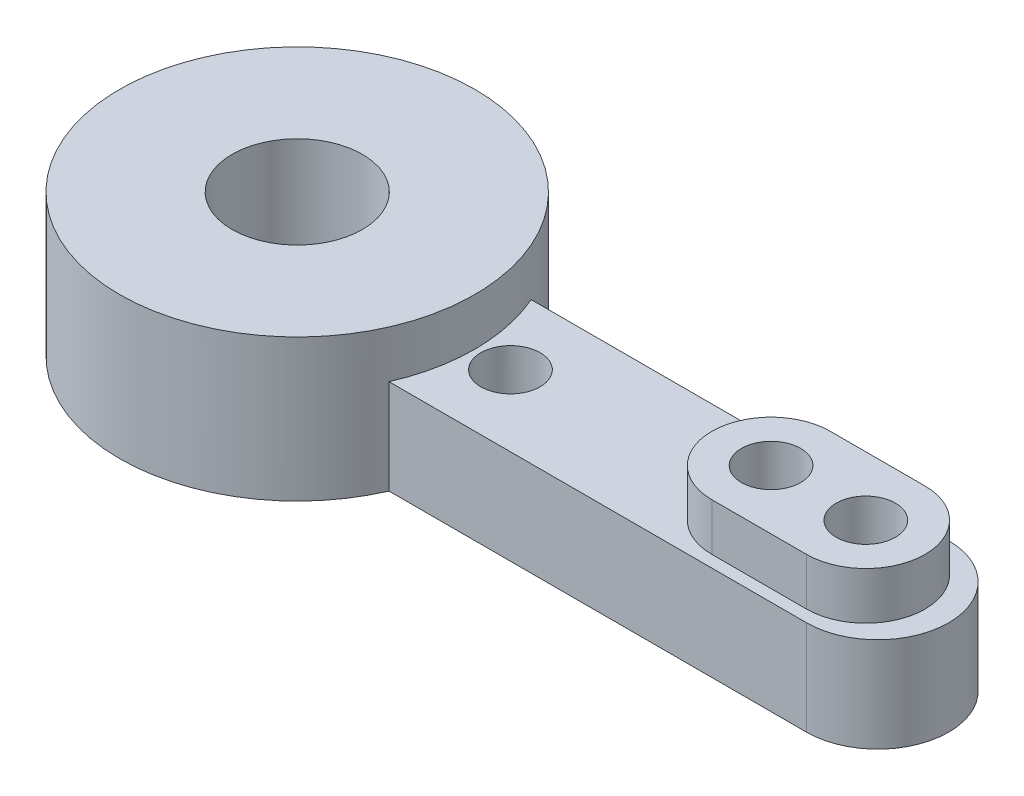
ISO-10303-21;
HEADER;
FILE_DESCRIPTION(('STEP AP214'),'2;1');
FILE_NAME('part.step','',(''),(''),'','','');
FILE_SCHEMA(('AUTOMOTIVE_DESIGN { 1 0 10303 214 1 1 1 1 }'));
ENDSEC;
DATA;
#1=APPLICATION_CONTEXT('core data for automotive mechanical design processes');
#2=APPLICATION_PROTOCOL_DEFINITION('international standard','automotive_design',2000,#1);
#3=PRODUCT_CONTEXT('',#1,'mechanical');
#4=PRODUCT('Part','Part','',(#3));
#5=PRODUCT_RELATED_PRODUCT_CATEGORY('part','',(#4));
#6=PRODUCT_DEFINITION_FORMATION('','',#4);
#7=PRODUCT_DEFINITION_CONTEXT('part definition',#1,'design');
#8=PRODUCT_DEFINITION('design','',#6,#7);
#9=PRODUCT_DEFINITION_SHAPE('','',#8);
#10=(LENGTH_UNIT() NAMED_UNIT(*) SI_UNIT(.MILLI.,.METRE.));
#11=(NAMED_UNIT(*) PLANE_ANGLE_UNIT() SI_UNIT($,.RADIAN.));
#12=(NAMED_UNIT(*) SI_UNIT($,.STERADIAN.) SOLID_ANGLE_UNIT());
#13=UNCERTAINTY_MEASURE_WITH_UNIT(LENGTH_MEASURE(1.E-05),#10,'distance_accuracy_value','');
#14=(GEOMETRIC_REPRESENTATION_CONTEXT(3) GLOBAL_UNCERTAINTY_ASSIGNED_CONTEXT((#13)) GLOBAL_UNIT_ASSIGNED_CONTEXT((#10,
#11,#12)) REPRESENTATION_CONTEXT('',''));
#15=CARTESIAN_POINT('',(0.,0.,0.));
#16=DIRECTION('',(0.,0.,1.));
#17=DIRECTION('',(1.,0.,0.));
#18=AXIS2_PLACEMENT_3D('',#15,#16,#17);
#19=CARTESIAN_POINT('',(0.,0.,0.));
#20=DIRECTION('',(0.,-1.,0.));
#21=DIRECTION('',(0.,0.,-1.));
#22=AXIS2_PLACEMENT_3D('',#19,#20,#21);
#23=CYLINDRICAL_SURFACE('',#22,1.25);
#24=CARTESIAN_POINT('',(0.,2.,0.));
#25=DIRECTION('',(0.,1.,0.));
#26=DIRECTION('',(0.,0.,1.));
#27=AXIS2_PLACEMENT_3D('',#24,#25,#26);
#28=CIRCLE('',#27,1.25);
#29=CARTESIAN_POINT('',(0.,2.,1.25));
#30=VERTEX_POINT('',#29);
#31=EDGE_CURVE('E188',#30,#30,#28,.F.);
#32=ORIENTED_EDGE('',*,*,#31,.F.);
#33=EDGE_LOOP('',(#32));
#34=FACE_BOUND('',#33,.T.);
#35=CARTESIAN_POINT('',(0.,0.75,0.));
#36=DIRECTION('',(0.,-1.,0.));
#37=DIRECTION('',(0.,0.,-1.));
#38=AXIS2_PLACEMENT_3D('',#35,#36,#37);
#39=CIRCLE('',#38,1.25);
#40=CARTESIAN_POINT('',(0.,0.75,-1.25));
#41=VERTEX_POINT('',#40);
#42=EDGE_CURVE('E51',#41,#41,#39,.F.);
#43=ORIENTED_EDGE('',*,*,#42,.F.);
#44=EDGE_LOOP('',(#43));
#45=FACE_BOUND('',#44,.T.);
#46=ADVANCED_FACE('F47',(#34,#45),#23,.F.);
#47=CARTESIAN_POINT('',(0.,6.,0.));
#48=DIRECTION('',(0.,1.,0.));
#49=DIRECTION('',(0.,0.,1.));
#50=AXIS2_PLACEMENT_3D('',#47,#48,#49);
#51=PLANE('',#50);
#52=CARTESIAN_POINT('',(20.,6.,0.));
#53=DIRECTION('',(0.,-1.,0.));
#54=DIRECTION('',(0.,0.,-1.));
#55=AXIS2_PLACEMENT_3D('',#52,#53,#54);
#56=CIRCLE('',#55,1.25);
#57=CARTESIAN_POINT('',(20.,6.,-1.25));
#58=VERTEX_POINT('',#57);
#59=EDGE_CURVE('E197',#58,#58,#56,.T.);
#60=ORIENTED_EDGE('',*,*,#59,.T.);
#61=EDGE_LOOP('',(#60));
#62=FACE_BOUND('',#61,.T.);
#63=CARTESIAN_POINT('',(20.,6.,0.));
#64=DIRECTION('',(0.,1.,0.));
#65=DIRECTION('',(0.,0.,1.));
#66=AXIS2_PLACEMENT_3D('',#63,#64,#65);
#67=CIRCLE('',#66,2.5);
#68=CARTESIAN_POINT('',(20.,6.,-2.5));
#69=VERTEX_POINT('',#68);
#70=CARTESIAN_POINT('',(20.,6.,2.5));
#71=VERTEX_POINT('',#70);
#72=EDGE_CURVE('E134',#69,#71,#67,.T.);
#73=ORIENTED_EDGE('',*,*,#72,.T.);
#74=DIRECTION('',(1.,0.,0.));
#75=VECTOR('',#74,1.);
#76=CARTESIAN_POINT('',(0.,6.,2.5));
#77=LINE('',#76,#75);
#78=CARTESIAN_POINT('',(24.,6.,2.5));
#79=VERTEX_POINT('',#78);
#80=EDGE_CURVE('E140',#71,#79,#77,.T.);
#81=ORIENTED_EDGE('',*,*,#80,.T.);
#82=CARTESIAN_POINT('',(24.,6.,0.));
#83=DIRECTION('',(0.,1.,0.));
#84=DIRECTION('',(0.,0.,1.));
#85=AXIS2_PLACEMENT_3D('',#82,#83,#84);
#86=CIRCLE('',#85,2.5);
#87=CARTESIAN_POINT('',(24.,6.,-2.5));
#88=VERTEX_POINT('',#87);
#89=EDGE_CURVE('E145',#79,#88,#86,.T.);
#90=ORIENTED_EDGE('',*,*,#89,.T.);
#91=DIRECTION('',(1.,0.,0.));
#92=VECTOR('',#91,1.);
#93=CARTESIAN_POINT('',(0.,6.,-2.5));
#94=LINE('',#93,#92);
#95=EDGE_CURVE('E125',#69,#88,#94,.T.);
#96=ORIENTED_EDGE('',*,*,#95,.F.);
#97=EDGE_LOOP('',(#73,#81,#90,#96));
#98=FACE_BOUND('',#97,.T.);
#99=CARTESIAN_POINT('',(24.,6.,0.));
#100=DIRECTION('',(0.,-1.,0.));
#101=DIRECTION('',(0.,0.,-1.));
#102=AXIS2_PLACEMENT_3D('',#99,#100,#101);
#103=CIRCLE('',#102,1.25);
#104=CARTESIAN_POINT('',(24.,6.,-1.25));
#105=VERTEX_POINT('',#104);
#106=EDGE_CURVE('E209',#105,#105,#103,.T.);
#107=ORIENTED_EDGE('',*,*,#106,.T.);
#108=EDGE_LOOP('',(#107));
#109=FACE_BOUND('',#108,.T.);
#110=ADVANCED_FACE('F143',(#62,#98,#109),#51,.T.);
#111=CARTESIAN_POINT('',(0.,0.,0.));
#112=DIRECTION('',(0.,1.,0.));
#113=DIRECTION('',(0.,0.,1.));
#114=AXIS2_PLACEMENT_3D('',#111,#112,#113);
#115=PLANE('',#114);
#116=CARTESIAN_POINT('',(0.,0.,0.));
#117=DIRECTION('',(0.,-1.,0.));
#118=DIRECTION('',(0.,0.,-1.));
#119=AXIS2_PLACEMENT_3D('',#116,#117,#118);
#120=CIRCLE('',#119,4.);
#121=CARTESIAN_POINT('',(0.,0.,-4.));
#122=VERTEX_POINT('',#121);
#123=EDGE_CURVE('E520',#122,#122,#120,.T.);
#124=ORIENTED_EDGE('',*,*,#123,.F.);
#125=EDGE_LOOP('',(#124));
#126=FACE_BOUND('',#125,.T.);
#127=CARTESIAN_POINT('',(20.,0.,0.));
#128=DIRECTION('',(0.,-1.,0.));
#129=DIRECTION('',(0.,0.,-1.));
#130=AXIS2_PLACEMENT_3D('',#127,#128,#129);
#131=CIRCLE('',#130,1.25);
#132=CARTESIAN_POINT('',(20.,0.,-1.25));
#133=VERTEX_POINT('',#132);
#134=EDGE_CURVE('E193',#133,#133,#131,.T.);
#135=ORIENTED_EDGE('',*,*,#134,.F.);
#136=EDGE_LOOP('',(#135));
#137=FACE_BOUND('',#136,.T.);
#138=CARTESIAN_POINT('',(24.,0.,0.));
#139=DIRECTION('',(0.,-1.,0.));
#140=DIRECTION('',(0.,0.,-1.));
#141=AXIS2_PLACEMENT_3D('',#138,#139,#140);
#142=CIRCLE('',#141,1.25);
#143=CARTESIAN_POINT('',(24.,0.,-1.25));
#144=VERTEX_POINT('',#143);
#145=EDGE_CURVE('E202',#144,#144,#142,.T.);
#146=ORIENTED_EDGE('',*,*,#145,.F.);
#147=EDGE_LOOP('',(#146));
#148=FACE_BOUND('',#147,.T.);
#149=CARTESIAN_POINT('',(0.,0.,0.));
#150=DIRECTION('',(0.,1.,0.));
#151=DIRECTION('',(0.,0.,1.));
#152=AXIS2_PLACEMENT_3D('',#149,#150,#151);
#153=CIRCLE('',#152,7.5);
#154=CARTESIAN_POINT('',(6.87386354243376,0.,-3.));
#155=VERTEX_POINT('',#154);
#156=CARTESIAN_POINT('',(6.87386354243376,0.,3.));
#157=VERTEX_POINT('',#156);
#158=EDGE_CURVE('E165',#155,#157,#153,.T.);
#159=ORIENTED_EDGE('',*,*,#158,.F.);
#160=DIRECTION('',(1.,0.,0.));
#161=VECTOR('',#160,1.);
#162=CARTESIAN_POINT('',(0.,0.,-3.));
#163=LINE('',#162,#161);
#164=CARTESIAN_POINT('',(24.5,0.,-3.));
#165=VERTEX_POINT('',#164);
#166=EDGE_CURVE('E168',#155,#165,#163,.T.);
#167=ORIENTED_EDGE('',*,*,#166,.T.);
#168=CARTESIAN_POINT('',(24.5,0.,0.));
#169=DIRECTION('',(0.,1.,0.));
#170=DIRECTION('',(0.,0.,1.));
#171=AXIS2_PLACEMENT_3D('',#168,#169,#170);
#172=CIRCLE('',#171,3.);
#173=CARTESIAN_POINT('',(24.5,0.,3.));
#174=VERTEX_POINT('',#173);
#175=EDGE_CURVE('E175',#174,#165,#172,.T.);
#176=ORIENTED_EDGE('',*,*,#175,.F.);
#177=DIRECTION('',(1.,0.,0.));
#178=VECTOR('',#177,1.);
#179=CARTESIAN_POINT('',(0.,0.,3.));
#180=LINE('',#179,#178);
#181=EDGE_CURVE('E173',#157,#174,#180,.T.);
#182=ORIENTED_EDGE('',*,*,#181,.F.);
#183=EDGE_LOOP('',(#159,#167,#176,#182));
#184=FACE_BOUND('',#183,.T.);
#185=CARTESIAN_POINT('',(9.,0.,0.));
#186=DIRECTION('',(0.,-1.,0.));
#187=DIRECTION('',(0.,0.,-1.));
#188=AXIS2_PLACEMENT_3D('',#185,#186,#187);
#189=CIRCLE('',#188,1.25);
#190=CARTESIAN_POINT('',(9.,0.,-1.25));
#191=VERTEX_POINT('',#190);
#192=EDGE_CURVE('E187',#191,#191,#189,.T.);
#193=ORIENTED_EDGE('',*,*,#192,.F.);
#194=EDGE_LOOP('',(#193));
#195=FACE_BOUND('',#194,.T.);
#196=ADVANCED_FACE('F240',(#126,#137,#148,#184,#195),#115,.F.);
#197=CARTESIAN_POINT('',(0.,6.,0.));
#198=DIRECTION('',(0.,1.,0.));
#199=DIRECTION('',(0.,0.,1.));
#200=AXIS2_PLACEMENT_3D('',#197,#198,#199);
#201=PLANE('',#200);
#202=CARTESIAN_POINT('',(0.,6.,0.));
#203=DIRECTION('',(0.,1.,0.));
#204=DIRECTION('',(0.,0.,1.));
#205=AXIS2_PLACEMENT_3D('',#202,#203,#204);
#206=CIRCLE('',#205,2.75);
#207=CARTESIAN_POINT('',(0.,6.,2.75));
#208=VERTEX_POINT('',#207);
#209=EDGE_CURVE('E190',#208,#208,#206,.F.);
#210=ORIENTED_EDGE('',*,*,#209,.T.);
#211=EDGE_LOOP('',(#210));
#212=FACE_BOUND('',#211,.T.);
#213=CARTESIAN_POINT('',(0.,6.,0.));
#214=DIRECTION('',(0.,1.,0.));
#215=DIRECTION('',(0.,0.,1.));
#216=AXIS2_PLACEMENT_3D('',#213,#214,#215);
#217=CIRCLE('',#216,7.5);
#218=CARTESIAN_POINT('',(0.,6.,7.5));
#219=VERTEX_POINT('',#218);
#220=EDGE_CURVE('E156',#219,#219,#217,.T.);
#221=ORIENTED_EDGE('',*,*,#220,.T.);
#222=EDGE_LOOP('',(#221));
#223=FACE_BOUND('',#222,.T.);
#224=ADVANCED_FACE('F265',(#212,#223),#201,.T.);
#225=CARTESIAN_POINT('',(0.,4.,0.));
#226=DIRECTION('',(0.,1.,0.));
#227=DIRECTION('',(0.,0.,1.));
#228=AXIS2_PLACEMENT_3D('',#225,#226,#227);
#229=PLANE('',#228);
#230=CARTESIAN_POINT('',(9.,4.,0.));
#231=DIRECTION('',(0.,1.,0.));
#232=DIRECTION('',(0.,0.,1.));
#233=AXIS2_PLACEMENT_3D('',#230,#231,#232);
#234=CIRCLE('',#233,1.25);
#235=CARTESIAN_POINT('',(9.,4.,1.25));
#236=VERTEX_POINT('',#235);
#237=EDGE_CURVE('E160',#236,#236,#234,.T.);
#238=ORIENTED_EDGE('',*,*,#237,.F.);
#239=EDGE_LOOP('',(#238));
#240=FACE_BOUND('',#239,.T.);
#241=CARTESIAN_POINT('',(24.,4.,0.));
#242=DIRECTION('',(0.,1.,0.));
#243=DIRECTION('',(0.,0.,1.));
#244=AXIS2_PLACEMENT_3D('',#241,#242,#243);
#245=CIRCLE('',#244,2.5);
#246=CARTESIAN_POINT('',(24.,4.,2.5));
#247=VERTEX_POINT('',#246);
#248=CARTESIAN_POINT('',(24.,4.,-2.5));
#249=VERTEX_POINT('',#248);
#250=EDGE_CURVE('E146',#247,#249,#245,.T.);
#251=ORIENTED_EDGE('',*,*,#250,.F.);
#252=DIRECTION('',(1.,0.,0.));
#253=VECTOR('',#252,1.);
#254=CARTESIAN_POINT('',(0.,4.,2.5));
#255=LINE('',#254,#253);
#256=CARTESIAN_POINT('',(20.,4.,2.5));
#257=VERTEX_POINT('',#256);
#258=EDGE_CURVE('E154',#257,#247,#255,.T.);
#259=ORIENTED_EDGE('',*,*,#258,.F.);
#260=CARTESIAN_POINT('',(20.,4.,0.));
#261=DIRECTION('',(0.,1.,0.));
#262=DIRECTION('',(0.,0.,1.));
#263=AXIS2_PLACEMENT_3D('',#260,#261,#262);
#264=CIRCLE('',#263,2.5);
#265=CARTESIAN_POINT('',(20.,4.,-2.5));
#266=VERTEX_POINT('',#265);
#267=EDGE_CURVE('E130',#266,#257,#264,.T.);
#268=ORIENTED_EDGE('',*,*,#267,.F.);
#269=DIRECTION('',(1.,0.,0.));
#270=VECTOR('',#269,1.);
#271=CARTESIAN_POINT('',(0.,4.,-2.5));
#272=LINE('',#271,#270);
#273=EDGE_CURVE('E64',#266,#249,#272,.T.);
#274=ORIENTED_EDGE('',*,*,#273,.T.);
#275=EDGE_LOOP('',(#251,#259,#268,#274));
#276=FACE_BOUND('',#275,.T.);
#277=DIRECTION('',(1.,0.,0.));
#278=VECTOR('',#277,1.);
#279=CARTESIAN_POINT('',(0.,4.,-3.));
#280=LINE('',#279,#278);
#281=CARTESIAN_POINT('',(6.87386354243376,4.,-3.));
#282=VERTEX_POINT('',#281);
#283=CARTESIAN_POINT('',(24.5,4.,-3.));
#284=VERTEX_POINT('',#283);
#285=EDGE_CURVE('E170',#282,#284,#280,.T.);
#286=ORIENTED_EDGE('',*,*,#285,.F.);
#287=CARTESIAN_POINT('',(0.,4.,0.));
#288=DIRECTION('',(0.,1.,0.));
#289=DIRECTION('',(0.,0.,1.));
#290=AXIS2_PLACEMENT_3D('',#287,#288,#289);
#291=CIRCLE('',#290,7.5);
#292=CARTESIAN_POINT('',(6.87386354243376,4.,3.));
#293=VERTEX_POINT('',#292);
#294=EDGE_CURVE('E163',#282,#293,#291,.F.);
#295=ORIENTED_EDGE('',*,*,#294,.T.);
#296=DIRECTION('',(1.,0.,0.));
#297=VECTOR('',#296,1.);
#298=CARTESIAN_POINT('',(0.,4.,3.));
#299=LINE('',#298,#297);
#300=CARTESIAN_POINT('',(24.5,4.,3.));
#301=VERTEX_POINT('',#300);
#302=EDGE_CURVE('E98',#293,#301,#299,.T.);
#303=ORIENTED_EDGE('',*,*,#302,.T.);
#304=CARTESIAN_POINT('',(24.5,4.,0.));
#305=DIRECTION('',(0.,1.,0.));
#306=DIRECTION('',(0.,0.,1.));
#307=AXIS2_PLACEMENT_3D('',#304,#305,#306);
#308=CIRCLE('',#307,3.);
#309=EDGE_CURVE('E167',#301,#284,#308,.T.);
#310=ORIENTED_EDGE('',*,*,#309,.T.);
#311=EDGE_LOOP('',(#286,#295,#303,#310));
#312=FACE_BOUND('',#311,.T.);
#313=ADVANCED_FACE('F217',(#240,#276,#312),#229,.T.);
#314=CARTESIAN_POINT('',(0.,4.,0.));
#315=DIRECTION('',(0.,-1.,0.));
#316=DIRECTION('',(0.,0.,-1.));
#317=AXIS2_PLACEMENT_3D('',#314,#315,#316);
#318=CYLINDRICAL_SURFACE('',#317,7.5);
#319=ORIENTED_EDGE('',*,*,#158,.T.);
#320=DIRECTION('',(0.,-1.,0.));
#321=VECTOR('',#320,1.);
#322=CARTESIAN_POINT('',(6.87386354243376,4.,3.));
#323=LINE('',#322,#321);
#324=EDGE_CURVE('E11',#293,#157,#323,.T.);
#325=ORIENTED_EDGE('',*,*,#324,.F.);
#326=ORIENTED_EDGE('',*,*,#294,.F.);
#327=DIRECTION('',(0.,-1.,0.));
#328=VECTOR('',#327,1.);
#329=CARTESIAN_POINT('',(6.87386354243376,4.,-3.));
#330=LINE('',#329,#328);
#331=EDGE_CURVE('E73',#282,#155,#330,.T.);
#332=ORIENTED_EDGE('',*,*,#331,.T.);
#333=EDGE_LOOP('',(#319,#325,#326,#332));
#334=FACE_BOUND('',#333,.T.);
#335=ORIENTED_EDGE('',*,*,#220,.F.);
#336=EDGE_LOOP('',(#335));
#337=FACE_BOUND('',#336,.T.);
#338=ADVANCED_FACE('F49',(#334,#337),#318,.T.);
#339=CARTESIAN_POINT('',(0.,4.,3.));
#340=DIRECTION('',(0.,0.,-1.));
#341=DIRECTION('',(-1.,0.,0.));
#342=AXIS2_PLACEMENT_3D('',#339,#340,#341);
#343=PLANE('',#342);
#344=ORIENTED_EDGE('',*,*,#181,.T.);
#345=DIRECTION('',(0.,-1.,0.));
#346=VECTOR('',#345,1.);
#347=CARTESIAN_POINT('',(24.5,4.,3.));
#348=LINE('',#347,#346);
#349=EDGE_CURVE('E56',#301,#174,#348,.T.);
#350=ORIENTED_EDGE('',*,*,#349,.F.);
#351=ORIENTED_EDGE('',*,*,#302,.F.);
#352=ORIENTED_EDGE('',*,*,#324,.T.);
#353=EDGE_LOOP('',(#344,#350,#351,#352));
#354=FACE_BOUND('',#353,.T.);
#355=ADVANCED_FACE('F280',(#354),#343,.F.);
#356=CARTESIAN_POINT('',(24.5,4.,0.));
#357=DIRECTION('',(0.,-1.,0.));
#358=DIRECTION('',(0.,0.,-1.));
#359=AXIS2_PLACEMENT_3D('',#356,#357,#358);
#360=CYLINDRICAL_SURFACE('',#359,3.);
#361=ORIENTED_EDGE('',*,*,#175,.T.);
#362=DIRECTION('',(0.,-1.,0.));
#363=VECTOR('',#362,1.);
#364=CARTESIAN_POINT('',(24.5,4.,-3.));
#365=LINE('',#364,#363);
#366=EDGE_CURVE('E181',#284,#165,#365,.T.);
#367=ORIENTED_EDGE('',*,*,#366,.F.);
#368=ORIENTED_EDGE('',*,*,#309,.F.);
#369=ORIENTED_EDGE('',*,*,#349,.T.);
#370=EDGE_LOOP('',(#361,#367,#368,#369));
#371=FACE_BOUND('',#370,.T.);
#372=ADVANCED_FACE('F278',(#371),#360,.T.);
#373=CARTESIAN_POINT('',(0.,4.,-3.));
#374=DIRECTION('',(0.,0.,-1.));
#375=DIRECTION('',(-1.,0.,0.));
#376=AXIS2_PLACEMENT_3D('',#373,#374,#375);
#377=PLANE('',#376);
#378=ORIENTED_EDGE('',*,*,#166,.F.);
#379=ORIENTED_EDGE('',*,*,#331,.F.);
#380=ORIENTED_EDGE('',*,*,#285,.T.);
#381=ORIENTED_EDGE('',*,*,#366,.T.);
#382=EDGE_LOOP('',(#378,#379,#380,#381));
#383=FACE_BOUND('',#382,.T.);
#384=ADVANCED_FACE('F232',(#383),#377,.T.);
#385=CARTESIAN_POINT('',(0.,16.295630140987,2.5));
#386=DIRECTION('',(0.,0.,-1.));
#387=DIRECTION('',(-1.,0.,0.));
#388=AXIS2_PLACEMENT_3D('',#385,#386,#387);
#389=PLANE('',#388);
#390=ORIENTED_EDGE('',*,*,#80,.F.);
#391=DIRECTION('',(0.,-1.,0.));
#392=VECTOR('',#391,1.);
#393=CARTESIAN_POINT('',(20.,16.295630140987,2.5));
#394=LINE('',#393,#392);
#395=EDGE_CURVE('E136',#71,#257,#394,.T.);
#396=ORIENTED_EDGE('',*,*,#395,.T.);
#397=ORIENTED_EDGE('',*,*,#258,.T.);
#398=DIRECTION('',(0.,-1.,0.));
#399=VECTOR('',#398,1.);
#400=CARTESIAN_POINT('',(24.,16.295630140987,2.5));
#401=LINE('',#400,#399);
#402=EDGE_CURVE('E150',#79,#247,#401,.T.);
#403=ORIENTED_EDGE('',*,*,#402,.F.);
#404=EDGE_LOOP('',(#390,#396,#397,#403));
#405=FACE_BOUND('',#404,.T.);
#406=ADVANCED_FACE('F222',(#405),#389,.F.);
#407=CARTESIAN_POINT('',(24.,16.295630140987,0.));
#408=DIRECTION('',(0.,-1.,0.));
#409=DIRECTION('',(0.,0.,-1.));
#410=AXIS2_PLACEMENT_3D('',#407,#408,#409);
#411=CYLINDRICAL_SURFACE('',#410,2.5);
#412=ORIENTED_EDGE('',*,*,#89,.F.);
#413=ORIENTED_EDGE('',*,*,#402,.T.);
#414=ORIENTED_EDGE('',*,*,#250,.T.);
#415=DIRECTION('',(0.,-1.,0.));
#416=VECTOR('',#415,1.);
#417=CARTESIAN_POINT('',(24.,16.295630140987,-2.5));
#418=LINE('',#417,#416);
#419=EDGE_CURVE('E131',#88,#249,#418,.T.);
#420=ORIENTED_EDGE('',*,*,#419,.F.);
#421=EDGE_LOOP('',(#412,#413,#414,#420));
#422=FACE_BOUND('',#421,.T.);
#423=ADVANCED_FACE('F224',(#422),#411,.T.);
#424=CARTESIAN_POINT('',(0.,16.295630140987,-2.5));
#425=DIRECTION('',(0.,0.,-1.));
#426=DIRECTION('',(-1.,0.,0.));
#427=AXIS2_PLACEMENT_3D('',#424,#425,#426);
#428=PLANE('',#427);
#429=DIRECTION('',(0.,-1.,0.));
#430=VECTOR('',#429,1.);
#431=CARTESIAN_POINT('',(20.,16.295630140987,-2.5));
#432=LINE('',#431,#430);
#433=EDGE_CURVE('E121',#69,#266,#432,.T.);
#434=ORIENTED_EDGE('',*,*,#433,.F.);
#435=ORIENTED_EDGE('',*,*,#95,.T.);
#436=ORIENTED_EDGE('',*,*,#419,.T.);
#437=ORIENTED_EDGE('',*,*,#273,.F.);
#438=EDGE_LOOP('',(#434,#435,#436,#437));
#439=FACE_BOUND('',#438,.T.);
#440=ADVANCED_FACE('F123',(#439),#428,.T.);
#441=CARTESIAN_POINT('',(20.,16.295630140987,0.));
#442=DIRECTION('',(0.,-1.,0.));
#443=DIRECTION('',(0.,0.,-1.));
#444=AXIS2_PLACEMENT_3D('',#441,#442,#443);
#445=CYLINDRICAL_SURFACE('',#444,2.5);
#446=ORIENTED_EDGE('',*,*,#72,.F.);
#447=ORIENTED_EDGE('',*,*,#433,.T.);
#448=ORIENTED_EDGE('',*,*,#267,.T.);
#449=ORIENTED_EDGE('',*,*,#395,.F.);
#450=EDGE_LOOP('',(#446,#447,#448,#449));
#451=FACE_BOUND('',#450,.T.);
#452=ADVANCED_FACE('F135',(#451),#445,.T.);
#453=CARTESIAN_POINT('',(9.,0.,0.));
#454=DIRECTION('',(0.,-1.,0.));
#455=DIRECTION('',(0.,0.,-1.));
#456=AXIS2_PLACEMENT_3D('',#453,#454,#455);
#457=CYLINDRICAL_SURFACE('',#456,1.25);
#458=ORIENTED_EDGE('',*,*,#237,.T.);
#459=EDGE_LOOP('',(#458));
#460=FACE_BOUND('',#459,.T.);
#461=ORIENTED_EDGE('',*,*,#192,.T.);
#462=EDGE_LOOP('',(#461));
#463=FACE_BOUND('',#462,.T.);
#464=ADVANCED_FACE('F247',(#460,#463),#457,.F.);
#465=CARTESIAN_POINT('',(24.,0.,0.));
#466=DIRECTION('',(0.,-1.,0.));
#467=DIRECTION('',(0.,0.,-1.));
#468=AXIS2_PLACEMENT_3D('',#465,#466,#467);
#469=CYLINDRICAL_SURFACE('',#468,1.25);
#470=ORIENTED_EDGE('',*,*,#106,.F.);
#471=EDGE_LOOP('',(#470));
#472=FACE_BOUND('',#471,.T.);
#473=ORIENTED_EDGE('',*,*,#145,.T.);
#474=EDGE_LOOP('',(#473));
#475=FACE_BOUND('',#474,.T.);
#476=ADVANCED_FACE('F253',(#472,#475),#469,.F.);
#477=CARTESIAN_POINT('',(20.,0.,0.));
#478=DIRECTION('',(0.,-1.,0.));
#479=DIRECTION('',(0.,0.,-1.));
#480=AXIS2_PLACEMENT_3D('',#477,#478,#479);
#481=CYLINDRICAL_SURFACE('',#480,1.25);
#482=ORIENTED_EDGE('',*,*,#59,.F.);
#483=EDGE_LOOP('',(#482));
#484=FACE_BOUND('',#483,.T.);
#485=ORIENTED_EDGE('',*,*,#134,.T.);
#486=EDGE_LOOP('',(#485));
#487=FACE_BOUND('',#486,.T.);
#488=ADVANCED_FACE('F258',(#484,#487),#481,.F.);
#489=CARTESIAN_POINT('',(0.,2.,0.));
#490=DIRECTION('',(0.,1.,0.));
#491=DIRECTION('',(0.,0.,1.));
#492=AXIS2_PLACEMENT_3D('',#489,#490,#491);
#493=PLANE('',#492);
#494=CARTESIAN_POINT('',(0.,2.,0.));
#495=DIRECTION('',(0.,1.,0.));
#496=DIRECTION('',(0.,0.,1.));
#497=AXIS2_PLACEMENT_3D('',#494,#495,#496);
#498=CIRCLE('',#497,2.75);
#499=CARTESIAN_POINT('',(0.,2.,2.75));
#500=VERTEX_POINT('',#499);
#501=EDGE_CURVE('E191',#500,#500,#498,.T.);
#502=ORIENTED_EDGE('',*,*,#501,.T.);
#503=EDGE_LOOP('',(#502));
#504=FACE_BOUND('',#503,.T.);
#505=ORIENTED_EDGE('',*,*,#31,.T.);
#506=EDGE_LOOP('',(#505));
#507=FACE_BOUND('',#506,.T.);
#508=ADVANCED_FACE('F360',(#504,#507),#493,.T.);
#509=CARTESIAN_POINT('',(0.,6.000012,0.));
#510=DIRECTION('',(0.,-1.,0.));
#511=DIRECTION('',(0.,0.,-1.));
#512=AXIS2_PLACEMENT_3D('',#509,#510,#511);
#513=CYLINDRICAL_SURFACE('',#512,2.75);
#514=ORIENTED_EDGE('',*,*,#209,.F.);
#515=EDGE_LOOP('',(#514));
#516=FACE_BOUND('',#515,.T.);
#517=ORIENTED_EDGE('',*,*,#501,.F.);
#518=EDGE_LOOP('',(#517));
#519=FACE_BOUND('',#518,.T.);
#520=ADVANCED_FACE('F371',(#516,#519),#513,.F.);
#521=CARTESIAN_POINT('',(0.,0.75,0.));
#522=DIRECTION('',(0.,-1.,0.));
#523=DIRECTION('',(0.,0.,-1.));
#524=AXIS2_PLACEMENT_3D('',#521,#522,#523);
#525=PLANE('',#524);
#526=CARTESIAN_POINT('',(0.,0.75,0.));
#527=DIRECTION('',(0.,-1.,0.));
#528=DIRECTION('',(0.,0.,-1.));
#529=AXIS2_PLACEMENT_3D('',#526,#527,#528);
#530=CIRCLE('',#529,4.);
#531=CARTESIAN_POINT('',(0.,0.75,-4.));
#532=VERTEX_POINT('',#531);
#533=EDGE_CURVE('E518',#532,#532,#530,.T.);
#534=ORIENTED_EDGE('',*,*,#533,.T.);
#535=EDGE_LOOP('',(#534));
#536=FACE_BOUND('',#535,.T.);
#537=ORIENTED_EDGE('',*,*,#42,.T.);
#538=EDGE_LOOP('',(#537));
#539=FACE_BOUND('',#538,.T.);
#540=ADVANCED_FACE('F381',(#536,#539),#525,.T.);
#541=CARTESIAN_POINT('',(0.,0.75,0.));
#542=DIRECTION('',(0.,-1.,0.));
#543=DIRECTION('',(0.,0.,-1.));
#544=AXIS2_PLACEMENT_3D('',#541,#542,#543);
#545=CYLINDRICAL_SURFACE('',#544,4.);
#546=ORIENTED_EDGE('',*,*,#533,.F.);
#547=EDGE_LOOP('',(#546));
#548=FACE_BOUND('',#547,.T.);
#549=ORIENTED_EDGE('',*,*,#123,.T.);
#550=EDGE_LOOP('',(#549));
#551=FACE_BOUND('',#550,.T.);
#552=ADVANCED_FACE('F392',(#548,#551),#545,.F.);
#553=CLOSED_SHELL('',(#46,#110,#196,#224,#313,#338,#355,#372,#384,#406,#423,#440,#452,#464,#476,
#488,#508,#520,#540,#552));
#554=MANIFOLD_SOLID_BREP('B2',#553);
#555=ADVANCED_BREP_SHAPE_REPRESENTATION('',(#18,#554),#14);
#556=SHAPE_DEFINITION_REPRESENTATION(#9,#555);
ENDSEC;
END-ISO-10303-21;
